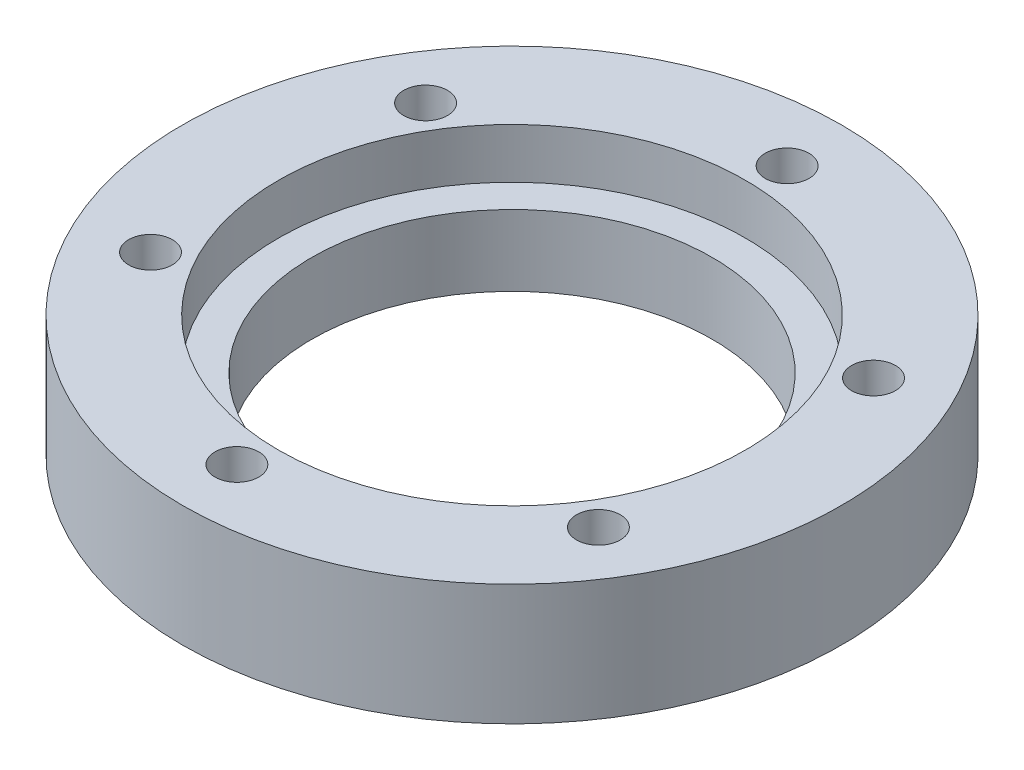
ISO-10303-21;
HEADER;
FILE_DESCRIPTION(('STEP AP214'),'2;1');
FILE_NAME('part.step','',(''),(''),'','','');
FILE_SCHEMA(('AUTOMOTIVE_DESIGN { 1 0 10303 214 1 1 1 1 }'));
ENDSEC;
DATA;
#1=APPLICATION_CONTEXT('core data for automotive mechanical design processes');
#2=APPLICATION_PROTOCOL_DEFINITION('international standard','automotive_design',2000,#1);
#3=PRODUCT_CONTEXT('',#1,'mechanical');
#4=PRODUCT('Part','Part','',(#3));
#5=PRODUCT_RELATED_PRODUCT_CATEGORY('part','',(#4));
#6=PRODUCT_DEFINITION_FORMATION('','',#4);
#7=PRODUCT_DEFINITION_CONTEXT('part definition',#1,'design');
#8=PRODUCT_DEFINITION('design','',#6,#7);
#9=PRODUCT_DEFINITION_SHAPE('','',#8);
#10=(LENGTH_UNIT() NAMED_UNIT(*) SI_UNIT(.MILLI.,.METRE.));
#11=(NAMED_UNIT(*) PLANE_ANGLE_UNIT() SI_UNIT($,.RADIAN.));
#12=(NAMED_UNIT(*) SI_UNIT($,.STERADIAN.) SOLID_ANGLE_UNIT());
#13=UNCERTAINTY_MEASURE_WITH_UNIT(LENGTH_MEASURE(1.E-05),#10,'distance_accuracy_value','');
#14=(GEOMETRIC_REPRESENTATION_CONTEXT(3) GLOBAL_UNCERTAINTY_ASSIGNED_CONTEXT((#13)) GLOBAL_UNIT_ASSIGNED_CONTEXT((#10,
#11,#12)) REPRESENTATION_CONTEXT('',''));
#15=CARTESIAN_POINT('',(0.,0.,0.));
#16=DIRECTION('',(0.,0.,1.));
#17=DIRECTION('',(1.,0.,0.));
#18=AXIS2_PLACEMENT_3D('',#15,#16,#17);
#19=CARTESIAN_POINT('',(0.,29.,0.));
#20=DIRECTION('',(0.,-1.,0.));
#21=DIRECTION('',(0.,0.,-1.));
#22=AXIS2_PLACEMENT_3D('',#19,#20,#21);
#23=CYLINDRICAL_SURFACE('',#22,79.);
#24=CARTESIAN_POINT('',(0.,29.,0.));
#25=DIRECTION('',(0.,1.,0.));
#26=DIRECTION('',(0.,0.,1.));
#27=AXIS2_PLACEMENT_3D('',#24,#25,#26);
#28=CIRCLE('',#27,79.);
#29=CARTESIAN_POINT('',(0.,29.,79.));
#30=VERTEX_POINT('',#29);
#31=EDGE_CURVE('E10',#30,#30,#28,.T.);
#32=ORIENTED_EDGE('',*,*,#31,.F.);
#33=EDGE_LOOP('',(#32));
#34=FACE_BOUND('',#33,.T.);
#35=CARTESIAN_POINT('',(0.,0.,0.));
#36=DIRECTION('',(0.,1.,0.));
#37=DIRECTION('',(0.,0.,1.));
#38=AXIS2_PLACEMENT_3D('',#35,#36,#37);
#39=CIRCLE('',#38,79.);
#40=CARTESIAN_POINT('',(0.,0.,79.));
#41=VERTEX_POINT('',#40);
#42=EDGE_CURVE('E40',#41,#41,#39,.T.);
#43=ORIENTED_EDGE('',*,*,#42,.T.);
#44=EDGE_LOOP('',(#43));
#45=FACE_BOUND('',#44,.T.);
#46=ADVANCED_FACE('F37',(#34,#45),#23,.T.);
#47=CARTESIAN_POINT('',(0.,29.,0.));
#48=DIRECTION('',(0.,1.,0.));
#49=DIRECTION('',(0.,0.,1.));
#50=AXIS2_PLACEMENT_3D('',#47,#48,#49);
#51=PLANE('',#50);
#52=CARTESIAN_POINT('',(54.4110067387568,29.,33.6963254031499));
#53=DIRECTION('',(0.,1.,0.));
#54=DIRECTION('',(0.,0.,1.));
#55=AXIS2_PLACEMENT_3D('',#52,#53,#54);
#56=CIRCLE('',#55,5.24999999999999);
#57=CARTESIAN_POINT('',(54.4110067387568,29.,38.9463254031499));
#58=VERTEX_POINT('',#57);
#59=EDGE_CURVE('E110',#58,#58,#56,.T.);
#60=ORIENTED_EDGE('',*,*,#59,.F.);
#61=EDGE_LOOP('',(#60));
#62=FACE_BOUND('',#61,.T.);
#63=CARTESIAN_POINT('',(-1.97637044393649,29.,63.9694767828246));
#64=DIRECTION('',(0.,1.,0.));
#65=DIRECTION('',(0.,0.,1.));
#66=AXIS2_PLACEMENT_3D('',#63,#64,#65);
#67=CIRCLE('',#66,5.24999999999999);
#68=CARTESIAN_POINT('',(-1.97637044393649,29.,69.2194767828246));
#69=VERTEX_POINT('',#68);
#70=EDGE_CURVE('E102',#69,#69,#67,.T.);
#71=ORIENTED_EDGE('',*,*,#70,.F.);
#72=EDGE_LOOP('',(#71));
#73=FACE_BOUND('',#72,.T.);
#74=CARTESIAN_POINT('',(-56.3873771826933,29.,30.2731513796745));
#75=DIRECTION('',(0.,1.,0.));
#76=DIRECTION('',(0.,0.,1.));
#77=AXIS2_PLACEMENT_3D('',#74,#75,#76);
#78=CIRCLE('',#77,5.24999999999999);
#79=CARTESIAN_POINT('',(-56.3873771826933,29.,35.5231513796744));
#80=VERTEX_POINT('',#79);
#81=EDGE_CURVE('E94',#80,#80,#78,.T.);
#82=ORIENTED_EDGE('',*,*,#81,.F.);
#83=EDGE_LOOP('',(#82));
#84=FACE_BOUND('',#83,.T.);
#85=CARTESIAN_POINT('',(-54.4110067387565,29.,-33.6963254031503));
#86=DIRECTION('',(0.,1.,0.));
#87=DIRECTION('',(0.,0.,1.));
#88=AXIS2_PLACEMENT_3D('',#85,#86,#87);
#89=CIRCLE('',#88,5.24999999999999);
#90=CARTESIAN_POINT('',(-54.4110067387565,29.,-28.4463254031503));
#91=VERTEX_POINT('',#90);
#92=EDGE_CURVE('E86',#91,#91,#89,.T.);
#93=ORIENTED_EDGE('',*,*,#92,.F.);
#94=EDGE_LOOP('',(#93));
#95=FACE_BOUND('',#94,.T.);
#96=CARTESIAN_POINT('',(1.97637044393694,29.,-63.9694767828246));
#97=DIRECTION('',(0.,1.,0.));
#98=DIRECTION('',(0.,0.,1.));
#99=AXIS2_PLACEMENT_3D('',#96,#97,#98);
#100=CIRCLE('',#99,5.24999999999999);
#101=CARTESIAN_POINT('',(1.97637044393694,29.,-58.7194767828246));
#102=VERTEX_POINT('',#101);
#103=EDGE_CURVE('E78',#102,#102,#100,.T.);
#104=ORIENTED_EDGE('',*,*,#103,.F.);
#105=EDGE_LOOP('',(#104));
#106=FACE_BOUND('',#105,.T.);
#107=CARTESIAN_POINT('',(56.3873771826935,29.,-30.273151379674));
#108=DIRECTION('',(0.,1.,0.));
#109=DIRECTION('',(0.,0.,1.));
#110=AXIS2_PLACEMENT_3D('',#107,#108,#109);
#111=CIRCLE('',#110,5.24999999999999);
#112=CARTESIAN_POINT('',(56.3873771826935,29.,-25.0231513796741));
#113=VERTEX_POINT('',#112);
#114=EDGE_CURVE('E70',#113,#113,#111,.T.);
#115=ORIENTED_EDGE('',*,*,#114,.F.);
#116=EDGE_LOOP('',(#115));
#117=FACE_BOUND('',#116,.T.);
#118=CARTESIAN_POINT('',(0.,29.,0.));
#119=DIRECTION('',(0.,1.,0.));
#120=DIRECTION('',(0.,0.,1.));
#121=AXIS2_PLACEMENT_3D('',#118,#119,#120);
#122=CIRCLE('',#121,56.000000014);
#123=CARTESIAN_POINT('',(0.,29.,56.000000014));
#124=VERTEX_POINT('',#123);
#125=EDGE_CURVE('E62',#124,#124,#122,.T.);
#126=ORIENTED_EDGE('',*,*,#125,.F.);
#127=EDGE_LOOP('',(#126));
#128=FACE_BOUND('',#127,.T.);
#129=ORIENTED_EDGE('',*,*,#31,.T.);
#130=EDGE_LOOP('',(#129));
#131=FACE_BOUND('',#130,.T.);
#132=ADVANCED_FACE('F117',(#62,#73,#84,#95,#106,#117,#128,#131),#51,.T.);
#133=CARTESIAN_POINT('',(0.,0.,0.));
#134=DIRECTION('',(0.,1.,0.));
#135=DIRECTION('',(0.,0.,1.));
#136=AXIS2_PLACEMENT_3D('',#133,#134,#135);
#137=PLANE('',#136);
#138=CARTESIAN_POINT('',(54.4110067387568,0.,33.6963254031499));
#139=DIRECTION('',(0.,1.,0.));
#140=DIRECTION('',(0.,0.,1.));
#141=AXIS2_PLACEMENT_3D('',#138,#139,#140);
#142=CIRCLE('',#141,5.25);
#143=CARTESIAN_POINT('',(54.4110067387568,0.,38.9463254031499));
#144=VERTEX_POINT('',#143);
#145=EDGE_CURVE('E106',#144,#144,#142,.T.);
#146=ORIENTED_EDGE('',*,*,#145,.T.);
#147=EDGE_LOOP('',(#146));
#148=FACE_BOUND('',#147,.T.);
#149=CARTESIAN_POINT('',(-1.97637044393649,0.,63.9694767828246));
#150=DIRECTION('',(0.,1.,0.));
#151=DIRECTION('',(0.,0.,1.));
#152=AXIS2_PLACEMENT_3D('',#149,#150,#151);
#153=CIRCLE('',#152,5.25);
#154=CARTESIAN_POINT('',(-1.97637044393649,0.,69.2194767828246));
#155=VERTEX_POINT('',#154);
#156=EDGE_CURVE('E98',#155,#155,#153,.T.);
#157=ORIENTED_EDGE('',*,*,#156,.T.);
#158=EDGE_LOOP('',(#157));
#159=FACE_BOUND('',#158,.T.);
#160=CARTESIAN_POINT('',(-56.3873771826933,0.,30.2731513796745));
#161=DIRECTION('',(0.,1.,0.));
#162=DIRECTION('',(0.,0.,1.));
#163=AXIS2_PLACEMENT_3D('',#160,#161,#162);
#164=CIRCLE('',#163,5.25);
#165=CARTESIAN_POINT('',(-56.3873771826933,0.,35.5231513796745));
#166=VERTEX_POINT('',#165);
#167=EDGE_CURVE('E90',#166,#166,#164,.T.);
#168=ORIENTED_EDGE('',*,*,#167,.T.);
#169=EDGE_LOOP('',(#168));
#170=FACE_BOUND('',#169,.T.);
#171=CARTESIAN_POINT('',(-54.4110067387565,0.,-33.6963254031503));
#172=DIRECTION('',(0.,1.,0.));
#173=DIRECTION('',(0.,0.,1.));
#174=AXIS2_PLACEMENT_3D('',#171,#172,#173);
#175=CIRCLE('',#174,5.25);
#176=CARTESIAN_POINT('',(-54.4110067387565,0.,-28.4463254031503));
#177=VERTEX_POINT('',#176);
#178=EDGE_CURVE('E82',#177,#177,#175,.T.);
#179=ORIENTED_EDGE('',*,*,#178,.T.);
#180=EDGE_LOOP('',(#179));
#181=FACE_BOUND('',#180,.T.);
#182=CARTESIAN_POINT('',(1.97637044393694,0.,-63.9694767828246));
#183=DIRECTION('',(0.,1.,0.));
#184=DIRECTION('',(0.,0.,1.));
#185=AXIS2_PLACEMENT_3D('',#182,#183,#184);
#186=CIRCLE('',#185,5.25);
#187=CARTESIAN_POINT('',(1.97637044393694,0.,-58.7194767828246));
#188=VERTEX_POINT('',#187);
#189=EDGE_CURVE('E74',#188,#188,#186,.T.);
#190=ORIENTED_EDGE('',*,*,#189,.T.);
#191=EDGE_LOOP('',(#190));
#192=FACE_BOUND('',#191,.T.);
#193=CARTESIAN_POINT('',(56.3873771826935,0.,-30.273151379674));
#194=DIRECTION('',(0.,1.,0.));
#195=DIRECTION('',(0.,0.,1.));
#196=AXIS2_PLACEMENT_3D('',#193,#194,#195);
#197=CIRCLE('',#196,5.25);
#198=CARTESIAN_POINT('',(56.3873771826935,0.,-25.023151379674));
#199=VERTEX_POINT('',#198);
#200=EDGE_CURVE('E66',#199,#199,#197,.T.);
#201=ORIENTED_EDGE('',*,*,#200,.T.);
#202=EDGE_LOOP('',(#201));
#203=FACE_BOUND('',#202,.T.);
#204=CARTESIAN_POINT('',(0.,0.,0.));
#205=DIRECTION('',(0.,1.,0.));
#206=DIRECTION('',(0.,0.,1.));
#207=AXIS2_PLACEMENT_3D('',#204,#205,#206);
#208=CIRCLE('',#207,48.000000012);
#209=CARTESIAN_POINT('',(0.,0.,48.000000012));
#210=VERTEX_POINT('',#209);
#211=EDGE_CURVE('E49',#210,#210,#208,.T.);
#212=ORIENTED_EDGE('',*,*,#211,.T.);
#213=EDGE_LOOP('',(#212));
#214=FACE_BOUND('',#213,.T.);
#215=ORIENTED_EDGE('',*,*,#42,.F.);
#216=EDGE_LOOP('',(#215));
#217=FACE_BOUND('',#216,.T.);
#218=ADVANCED_FACE('F120',(#148,#159,#170,#181,#192,#203,#214,#217),#137,.F.);
#219=CARTESIAN_POINT('',(0.,29.,0.));
#220=DIRECTION('',(0.,1.,0.));
#221=DIRECTION('',(0.,0.,1.));
#222=AXIS2_PLACEMENT_3D('',#219,#220,#221);
#223=CYLINDRICAL_SURFACE('',#222,48.000000012);
#224=ORIENTED_EDGE('',*,*,#211,.F.);
#225=EDGE_LOOP('',(#224));
#226=FACE_BOUND('',#225,.T.);
#227=CARTESIAN_POINT('',(0.,17.000000124,0.));
#228=DIRECTION('',(0.,1.,0.));
#229=DIRECTION('',(0.,0.,1.));
#230=AXIS2_PLACEMENT_3D('',#227,#228,#229);
#231=CIRCLE('',#230,48.000000012);
#232=CARTESIAN_POINT('',(0.,17.000000124,48.000000012));
#233=VERTEX_POINT('',#232);
#234=EDGE_CURVE('E54',#233,#233,#231,.T.);
#235=ORIENTED_EDGE('',*,*,#234,.T.);
#236=EDGE_LOOP('',(#235));
#237=FACE_BOUND('',#236,.T.);
#238=ADVANCED_FACE('F147',(#226,#237),#223,.F.);
#239=CARTESIAN_POINT('',(48.000000012,17.000000124,0.));
#240=DIRECTION('',(0.,-1.,0.));
#241=DIRECTION('',(0.,0.,-1.));
#242=AXIS2_PLACEMENT_3D('',#239,#240,#241);
#243=PLANE('',#242);
#244=ORIENTED_EDGE('',*,*,#234,.F.);
#245=EDGE_LOOP('',(#244));
#246=FACE_BOUND('',#245,.T.);
#247=CARTESIAN_POINT('',(0.,17.000000124,0.));
#248=DIRECTION('',(0.,1.,0.));
#249=DIRECTION('',(0.,0.,1.));
#250=AXIS2_PLACEMENT_3D('',#247,#248,#249);
#251=CIRCLE('',#250,56.000000014);
#252=CARTESIAN_POINT('',(0.,17.000000124,56.000000014));
#253=VERTEX_POINT('',#252);
#254=EDGE_CURVE('E58',#253,#253,#251,.T.);
#255=ORIENTED_EDGE('',*,*,#254,.T.);
#256=EDGE_LOOP('',(#255));
#257=FACE_BOUND('',#256,.T.);
#258=ADVANCED_FACE('F137',(#246,#257),#243,.F.);
#259=CARTESIAN_POINT('',(0.,29.,0.));
#260=DIRECTION('',(0.,1.,0.));
#261=DIRECTION('',(0.,0.,1.));
#262=AXIS2_PLACEMENT_3D('',#259,#260,#261);
#263=CYLINDRICAL_SURFACE('',#262,56.000000014);
#264=ORIENTED_EDGE('',*,*,#254,.F.);
#265=EDGE_LOOP('',(#264));
#266=FACE_BOUND('',#265,.T.);
#267=ORIENTED_EDGE('',*,*,#125,.T.);
#268=EDGE_LOOP('',(#267));
#269=FACE_BOUND('',#268,.T.);
#270=ADVANCED_FACE('F134',(#266,#269),#263,.F.);
#271=CARTESIAN_POINT('',(56.3873771826935,29.,-30.273151379674));
#272=DIRECTION('',(0.,1.,0.));
#273=DIRECTION('',(0.,0.,1.));
#274=AXIS2_PLACEMENT_3D('',#271,#272,#273);
#275=CYLINDRICAL_SURFACE('',#274,5.24999999999999);
#276=ORIENTED_EDGE('',*,*,#200,.F.);
#277=EDGE_LOOP('',(#276));
#278=FACE_BOUND('',#277,.T.);
#279=ORIENTED_EDGE('',*,*,#114,.T.);
#280=EDGE_LOOP('',(#279));
#281=FACE_BOUND('',#280,.T.);
#282=ADVANCED_FACE('F136',(#278,#281),#275,.F.);
#283=CARTESIAN_POINT('',(1.97637044393694,29.,-63.9694767828246));
#284=DIRECTION('',(0.,1.,0.));
#285=DIRECTION('',(0.,0.,1.));
#286=AXIS2_PLACEMENT_3D('',#283,#284,#285);
#287=CYLINDRICAL_SURFACE('',#286,5.24999999999999);
#288=ORIENTED_EDGE('',*,*,#189,.F.);
#289=EDGE_LOOP('',(#288));
#290=FACE_BOUND('',#289,.T.);
#291=ORIENTED_EDGE('',*,*,#103,.T.);
#292=EDGE_LOOP('',(#291));
#293=FACE_BOUND('',#292,.T.);
#294=ADVANCED_FACE('F144',(#290,#293),#287,.F.);
#295=CARTESIAN_POINT('',(-54.4110067387565,29.,-33.6963254031503));
#296=DIRECTION('',(0.,1.,0.));
#297=DIRECTION('',(0.,0.,1.));
#298=AXIS2_PLACEMENT_3D('',#295,#296,#297);
#299=CYLINDRICAL_SURFACE('',#298,5.24999999999999);
#300=ORIENTED_EDGE('',*,*,#178,.F.);
#301=EDGE_LOOP('',(#300));
#302=FACE_BOUND('',#301,.T.);
#303=ORIENTED_EDGE('',*,*,#92,.T.);
#304=EDGE_LOOP('',(#303));
#305=FACE_BOUND('',#304,.T.);
#306=ADVANCED_FACE('F185',(#302,#305),#299,.F.);
#307=CARTESIAN_POINT('',(-56.3873771826933,29.,30.2731513796745));
#308=DIRECTION('',(0.,1.,0.));
#309=DIRECTION('',(0.,0.,1.));
#310=AXIS2_PLACEMENT_3D('',#307,#308,#309);
#311=CYLINDRICAL_SURFACE('',#310,5.24999999999999);
#312=ORIENTED_EDGE('',*,*,#167,.F.);
#313=EDGE_LOOP('',(#312));
#314=FACE_BOUND('',#313,.T.);
#315=ORIENTED_EDGE('',*,*,#81,.T.);
#316=EDGE_LOOP('',(#315));
#317=FACE_BOUND('',#316,.T.);
#318=ADVANCED_FACE('F190',(#314,#317),#311,.F.);
#319=CARTESIAN_POINT('',(-1.97637044393649,29.,63.9694767828246));
#320=DIRECTION('',(0.,1.,0.));
#321=DIRECTION('',(0.,0.,1.));
#322=AXIS2_PLACEMENT_3D('',#319,#320,#321);
#323=CYLINDRICAL_SURFACE('',#322,5.24999999999999);
#324=ORIENTED_EDGE('',*,*,#156,.F.);
#325=EDGE_LOOP('',(#324));
#326=FACE_BOUND('',#325,.T.);
#327=ORIENTED_EDGE('',*,*,#70,.T.);
#328=EDGE_LOOP('',(#327));
#329=FACE_BOUND('',#328,.T.);
#330=ADVANCED_FACE('F196',(#326,#329),#323,.F.);
#331=CARTESIAN_POINT('',(54.4110067387568,29.,33.6963254031499));
#332=DIRECTION('',(0.,1.,0.));
#333=DIRECTION('',(0.,0.,1.));
#334=AXIS2_PLACEMENT_3D('',#331,#332,#333);
#335=CYLINDRICAL_SURFACE('',#334,5.24999999999999);
#336=ORIENTED_EDGE('',*,*,#145,.F.);
#337=EDGE_LOOP('',(#336));
#338=FACE_BOUND('',#337,.T.);
#339=ORIENTED_EDGE('',*,*,#59,.T.);
#340=EDGE_LOOP('',(#339));
#341=FACE_BOUND('',#340,.T.);
#342=ADVANCED_FACE('F115',(#338,#341),#335,.F.);
#343=CLOSED_SHELL('',(#46,#132,#218,#238,#258,#270,#282,#294,#306,#318,#330,#342));
#344=MANIFOLD_SOLID_BREP('B2',#343);
#345=ADVANCED_BREP_SHAPE_REPRESENTATION('',(#18,#344),#14);
#346=SHAPE_DEFINITION_REPRESENTATION(#9,#345);
ENDSEC;
END-ISO-10303-21;
